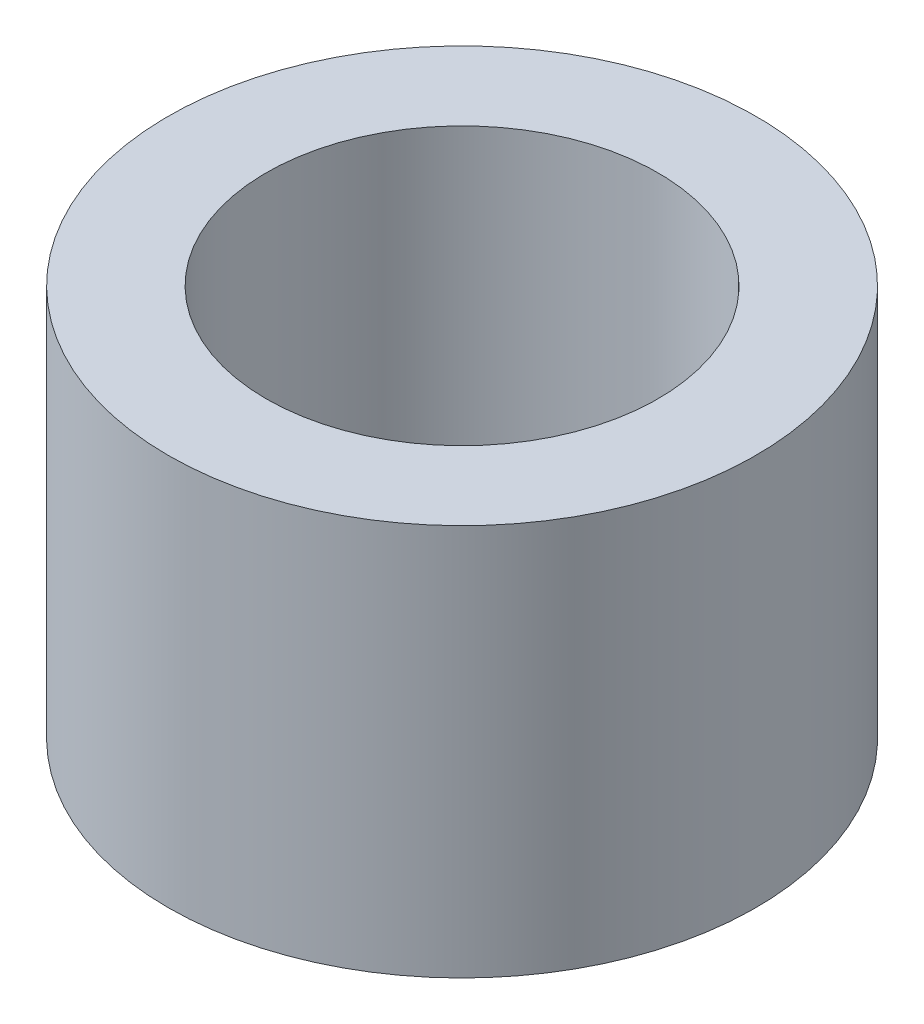
ISO-10303-21;
HEADER;
FILE_DESCRIPTION(('STEP AP214'),'2;1');
FILE_NAME('part.step','',(''),(''),'','','');
FILE_SCHEMA(('AUTOMOTIVE_DESIGN { 1 0 10303 214 1 1 1 1 }'));
ENDSEC;
DATA;
#1=APPLICATION_CONTEXT('core data for automotive mechanical design processes');
#2=APPLICATION_PROTOCOL_DEFINITION('international standard','automotive_design',2000,#1);
#3=PRODUCT_CONTEXT('',#1,'mechanical');
#4=PRODUCT('Part','Part','',(#3));
#5=PRODUCT_RELATED_PRODUCT_CATEGORY('part','',(#4));
#6=PRODUCT_DEFINITION_FORMATION('','',#4);
#7=PRODUCT_DEFINITION_CONTEXT('part definition',#1,'design');
#8=PRODUCT_DEFINITION('design','',#6,#7);
#9=PRODUCT_DEFINITION_SHAPE('','',#8);
#10=(LENGTH_UNIT() NAMED_UNIT(*) SI_UNIT(.MILLI.,.METRE.));
#11=(NAMED_UNIT(*) PLANE_ANGLE_UNIT() SI_UNIT($,.RADIAN.));
#12=(NAMED_UNIT(*) SI_UNIT($,.STERADIAN.) SOLID_ANGLE_UNIT());
#13=UNCERTAINTY_MEASURE_WITH_UNIT(LENGTH_MEASURE(1.E-05),#10,'distance_accuracy_value','');
#14=(GEOMETRIC_REPRESENTATION_CONTEXT(3) GLOBAL_UNCERTAINTY_ASSIGNED_CONTEXT((#13)) GLOBAL_UNIT_ASSIGNED_CONTEXT((#10,
#11,#12)) REPRESENTATION_CONTEXT('',''));
#15=CARTESIAN_POINT('',(0.,0.,0.));
#16=DIRECTION('',(0.,0.,1.));
#17=DIRECTION('',(1.,0.,0.));
#18=AXIS2_PLACEMENT_3D('',#15,#16,#17);
#19=CARTESIAN_POINT('',(0.,6.35,0.));
#20=DIRECTION('',(0.,1.,0.));
#21=DIRECTION('',(0.,0.,1.));
#22=AXIS2_PLACEMENT_3D('',#19,#20,#21);
#23=PLANE('',#22);
#24=CARTESIAN_POINT('',(0.,6.35,0.));
#25=DIRECTION('',(0.,1.,0.));
#26=DIRECTION('',(0.,0.,1.));
#27=AXIS2_PLACEMENT_3D('',#24,#25,#26);
#28=CIRCLE('',#27,4.7625);
#29=CARTESIAN_POINT('',(0.,6.35,4.7625));
#30=VERTEX_POINT('',#29);
#31=EDGE_CURVE('E10',#30,#30,#28,.T.);
#32=ORIENTED_EDGE('',*,*,#31,.T.);
#33=EDGE_LOOP('',(#32));
#34=FACE_BOUND('',#33,.T.);
#35=CARTESIAN_POINT('',(0.,6.35,0.));
#36=DIRECTION('',(0.,1.,0.));
#37=DIRECTION('',(0.,0.,1.));
#38=AXIS2_PLACEMENT_3D('',#35,#36,#37);
#39=CIRCLE('',#38,3.175);
#40=CARTESIAN_POINT('',(0.,6.35,3.175));
#41=VERTEX_POINT('',#40);
#42=EDGE_CURVE('E42',#41,#41,#39,.T.);
#43=ORIENTED_EDGE('',*,*,#42,.F.);
#44=EDGE_LOOP('',(#43));
#45=FACE_BOUND('',#44,.T.);
#46=ADVANCED_FACE('F31',(#34,#45),#23,.T.);
#47=CARTESIAN_POINT('',(0.,0.,0.));
#48=DIRECTION('',(0.,1.,0.));
#49=DIRECTION('',(0.,0.,1.));
#50=AXIS2_PLACEMENT_3D('',#47,#48,#49);
#51=PLANE('',#50);
#52=CARTESIAN_POINT('',(0.,0.,0.));
#53=DIRECTION('',(0.,1.,0.));
#54=DIRECTION('',(0.,0.,1.));
#55=AXIS2_PLACEMENT_3D('',#52,#53,#54);
#56=CIRCLE('',#55,4.7625);
#57=CARTESIAN_POINT('',(0.,0.,4.7625));
#58=VERTEX_POINT('',#57);
#59=EDGE_CURVE('E35',#58,#58,#56,.T.);
#60=ORIENTED_EDGE('',*,*,#59,.F.);
#61=EDGE_LOOP('',(#60));
#62=FACE_BOUND('',#61,.T.);
#63=CARTESIAN_POINT('',(0.,0.,0.));
#64=DIRECTION('',(0.,1.,0.));
#65=DIRECTION('',(0.,0.,1.));
#66=AXIS2_PLACEMENT_3D('',#63,#64,#65);
#67=CIRCLE('',#66,3.175);
#68=CARTESIAN_POINT('',(0.,0.,3.175));
#69=VERTEX_POINT('',#68);
#70=EDGE_CURVE('E44',#69,#69,#67,.T.);
#71=ORIENTED_EDGE('',*,*,#70,.T.);
#72=EDGE_LOOP('',(#71));
#73=FACE_BOUND('',#72,.T.);
#74=ADVANCED_FACE('F54',(#62,#73),#51,.F.);
#75=CARTESIAN_POINT('',(0.,6.35,0.));
#76=DIRECTION('',(0.,-1.,0.));
#77=DIRECTION('',(0.,0.,-1.));
#78=AXIS2_PLACEMENT_3D('',#75,#76,#77);
#79=CYLINDRICAL_SURFACE('',#78,4.7625);
#80=ORIENTED_EDGE('',*,*,#31,.F.);
#81=EDGE_LOOP('',(#80));
#82=FACE_BOUND('',#81,.T.);
#83=ORIENTED_EDGE('',*,*,#59,.T.);
#84=EDGE_LOOP('',(#83));
#85=FACE_BOUND('',#84,.T.);
#86=ADVANCED_FACE('F33',(#82,#85),#79,.T.);
#87=CARTESIAN_POINT('',(0.,6.35,0.));
#88=DIRECTION('',(0.,-1.,0.));
#89=DIRECTION('',(0.,0.,-1.));
#90=AXIS2_PLACEMENT_3D('',#87,#88,#89);
#91=CYLINDRICAL_SURFACE('',#90,3.175);
#92=ORIENTED_EDGE('',*,*,#42,.T.);
#93=EDGE_LOOP('',(#92));
#94=FACE_BOUND('',#93,.T.);
#95=ORIENTED_EDGE('',*,*,#70,.F.);
#96=EDGE_LOOP('',(#95));
#97=FACE_BOUND('',#96,.T.);
#98=ADVANCED_FACE('F50',(#94,#97),#91,.F.);
#99=CLOSED_SHELL('',(#46,#74,#86,#98));
#100=MANIFOLD_SOLID_BREP('B2',#99);
#101=ADVANCED_BREP_SHAPE_REPRESENTATION('',(#18,#100),#14);
#102=SHAPE_DEFINITION_REPRESENTATION(#9,#101);
ENDSEC;
END-ISO-10303-21;
